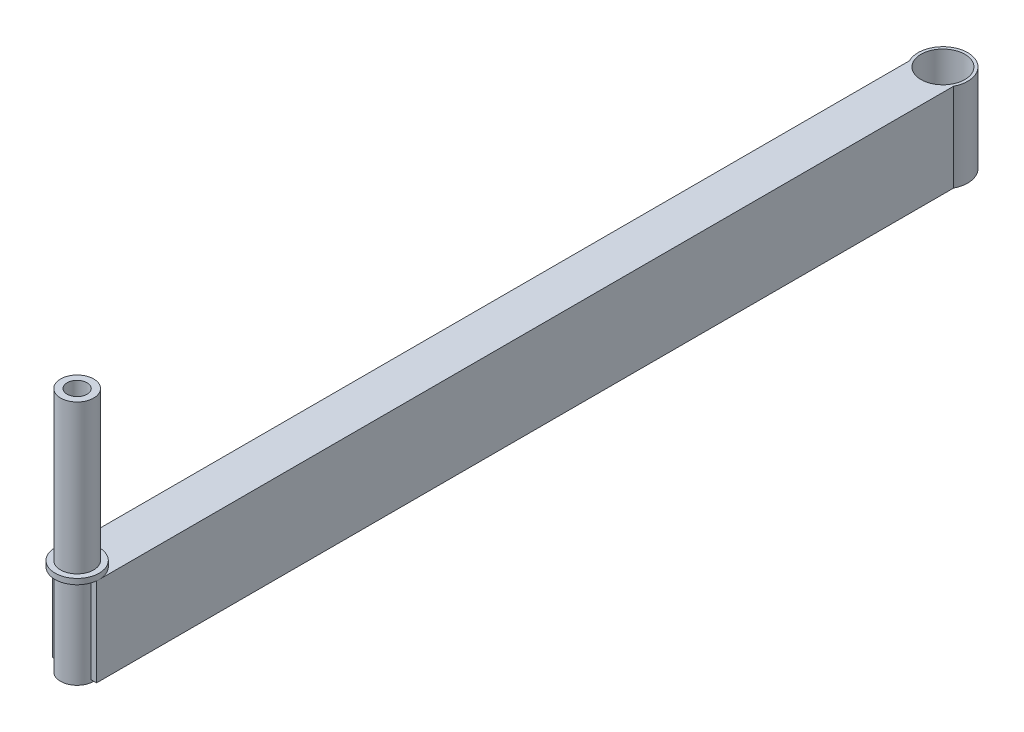
ISO-10303-21;
HEADER;
FILE_DESCRIPTION(('STEP AP214'),'2;1');
FILE_NAME('part.step','',(''),(''),'','','');
FILE_SCHEMA(('AUTOMOTIVE_DESIGN { 1 0 10303 214 1 1 1 1 }'));
ENDSEC;
DATA;
#1=APPLICATION_CONTEXT('core data for automotive mechanical design processes');
#2=APPLICATION_PROTOCOL_DEFINITION('international standard','automotive_design',2000,#1);
#3=PRODUCT_CONTEXT('',#1,'mechanical');
#4=PRODUCT('Part','Part','',(#3));
#5=PRODUCT_RELATED_PRODUCT_CATEGORY('part','',(#4));
#6=PRODUCT_DEFINITION_FORMATION('','',#4);
#7=PRODUCT_DEFINITION_CONTEXT('part definition',#1,'design');
#8=PRODUCT_DEFINITION('design','',#6,#7);
#9=PRODUCT_DEFINITION_SHAPE('','',#8);
#10=(LENGTH_UNIT() NAMED_UNIT(*) SI_UNIT(.MILLI.,.METRE.));
#11=(NAMED_UNIT(*) PLANE_ANGLE_UNIT() SI_UNIT($,.RADIAN.));
#12=(NAMED_UNIT(*) SI_UNIT($,.STERADIAN.) SOLID_ANGLE_UNIT());
#13=UNCERTAINTY_MEASURE_WITH_UNIT(LENGTH_MEASURE(1.E-05),#10,'distance_accuracy_value','');
#14=(GEOMETRIC_REPRESENTATION_CONTEXT(3) GLOBAL_UNCERTAINTY_ASSIGNED_CONTEXT((#13)) GLOBAL_UNIT_ASSIGNED_CONTEXT((#10,
#11,#12)) REPRESENTATION_CONTEXT('',''));
#15=CARTESIAN_POINT('',(0.,0.,0.));
#16=DIRECTION('',(0.,0.,1.));
#17=DIRECTION('',(1.,0.,0.));
#18=AXIS2_PLACEMENT_3D('',#15,#16,#17);
#19=CARTESIAN_POINT('',(0.,-26.9875,498.475));
#20=DIRECTION('',(0.,1.,0.));
#21=DIRECTION('',(0.,0.,1.));
#22=AXIS2_PLACEMENT_3D('',#19,#20,#21);
#23=CYLINDRICAL_SURFACE('',#22,9.525);
#24=DIRECTION('',(0.,1.,0.));
#25=VECTOR('',#24,1.);
#26=CARTESIAN_POINT('',(-9.40228956159084,-26.9875,499.999));
#27=LINE('',#26,#25);
#28=CARTESIAN_POINT('',(-9.40228956159084,25.4,499.999));
#29=VERTEX_POINT('',#28);
#30=CARTESIAN_POINT('',(-9.40228956159084,-25.4,499.999));
#31=VERTEX_POINT('',#30);
#32=EDGE_CURVE('E191',#29,#31,#27,.F.);
#33=ORIENTED_EDGE('',*,*,#32,.T.);
#34=CARTESIAN_POINT('',(0.,-25.4,498.475));
#35=DIRECTION('',(0.,1.,0.));
#36=DIRECTION('',(0.,0.,1.));
#37=AXIS2_PLACEMENT_3D('',#34,#35,#36);
#38=CIRCLE('',#37,9.525);
#39=CARTESIAN_POINT('',(9.40228956159083,-25.4,499.999));
#40=VERTEX_POINT('',#39);
#41=EDGE_CURVE('E179',#40,#31,#38,.T.);
#42=ORIENTED_EDGE('',*,*,#41,.F.);
#43=DIRECTION('',(0.,1.,0.));
#44=VECTOR('',#43,1.);
#45=CARTESIAN_POINT('',(9.40228956159083,-26.9875,499.999));
#46=LINE('',#45,#44);
#47=CARTESIAN_POINT('',(9.40228956159083,25.4,499.999));
#48=VERTEX_POINT('',#47);
#49=EDGE_CURVE('E202',#40,#48,#46,.T.);
#50=ORIENTED_EDGE('',*,*,#49,.T.);
#51=CARTESIAN_POINT('',(0.,25.4,498.475));
#52=DIRECTION('',(0.,1.,0.));
#53=DIRECTION('',(0.,0.,1.));
#54=AXIS2_PLACEMENT_3D('',#51,#52,#53);
#55=CIRCLE('',#54,9.525);
#56=EDGE_CURVE('E318',#48,#29,#55,.F.);
#57=ORIENTED_EDGE('',*,*,#56,.T.);
#58=EDGE_LOOP('',(#33,#42,#50,#57));
#59=FACE_BOUND('',#58,.T.);
#60=CARTESIAN_POINT('',(0.,-26.9875,498.475));
#61=DIRECTION('',(0.,1.,0.));
#62=DIRECTION('',(0.,0.,1.));
#63=AXIS2_PLACEMENT_3D('',#60,#61,#62);
#64=CIRCLE('',#63,9.525);
#65=CARTESIAN_POINT('',(0.,-26.9875,508.));
#66=VERTEX_POINT('',#65);
#67=EDGE_CURVE('E236',#66,#66,#64,.T.);
#68=ORIENTED_EDGE('',*,*,#67,.T.);
#69=EDGE_LOOP('',(#68));
#70=FACE_BOUND('',#69,.T.);
#71=ADVANCED_FACE('F48',(#59,#70),#23,.T.);
#72=CARTESIAN_POINT('',(0.,-26.9875,498.475));
#73=DIRECTION('',(0.,1.,0.));
#74=DIRECTION('',(0.,0.,1.));
#75=AXIS2_PLACEMENT_3D('',#72,#73,#74);
#76=CYLINDRICAL_SURFACE('',#75,6.35);
#77=CARTESIAN_POINT('',(0.,-26.9875,498.475));
#78=DIRECTION('',(0.,1.,0.));
#79=DIRECTION('',(0.,0.,1.));
#80=AXIS2_PLACEMENT_3D('',#77,#78,#79);
#81=CIRCLE('',#80,6.35);
#82=CARTESIAN_POINT('',(0.,-26.9875,504.825));
#83=VERTEX_POINT('',#82);
#84=EDGE_CURVE('E233',#83,#83,#81,.T.);
#85=ORIENTED_EDGE('',*,*,#84,.F.);
#86=EDGE_LOOP('',(#85));
#87=FACE_BOUND('',#86,.T.);
#88=CARTESIAN_POINT('',(0.,95.25,498.475));
#89=DIRECTION('',(0.,1.,0.));
#90=DIRECTION('',(0.,0.,1.));
#91=AXIS2_PLACEMENT_3D('',#88,#89,#90);
#92=CIRCLE('',#91,6.35);
#93=CARTESIAN_POINT('',(0.,95.25,504.825));
#94=VERTEX_POINT('',#93);
#95=EDGE_CURVE('E11',#94,#94,#92,.F.);
#96=ORIENTED_EDGE('',*,*,#95,.F.);
#97=EDGE_LOOP('',(#96));
#98=FACE_BOUND('',#97,.T.);
#99=ADVANCED_FACE('F353',(#87,#98),#76,.F.);
#100=CARTESIAN_POINT('',(-12.7,25.4,498.475));
#101=DIRECTION('',(0.,-1.,0.));
#102=DIRECTION('',(0.,0.,-1.));
#103=AXIS2_PLACEMENT_3D('',#100,#101,#102);
#104=PLANE('',#103);
#105=CARTESIAN_POINT('',(0.,25.4,0.));
#106=DIRECTION('',(0.,1.,0.));
#107=DIRECTION('',(0.,0.,1.));
#108=AXIS2_PLACEMENT_3D('',#105,#106,#107);
#109=CIRCLE('',#108,12.6365);
#110=CARTESIAN_POINT('',(0.,25.4,12.6365));
#111=VERTEX_POINT('',#110);
#112=EDGE_CURVE('E239',#111,#111,#109,.T.);
#113=ORIENTED_EDGE('',*,*,#112,.F.);
#114=EDGE_LOOP('',(#113));
#115=FACE_BOUND('',#114,.T.);
#116=CARTESIAN_POINT('',(0.,25.4,498.475));
#117=DIRECTION('',(0.,1.,0.));
#118=DIRECTION('',(0.,0.,1.));
#119=AXIS2_PLACEMENT_3D('',#116,#117,#118);
#120=CIRCLE('',#119,12.7);
#121=CARTESIAN_POINT('',(12.7,25.4,498.475));
#122=VERTEX_POINT('',#121);
#123=CARTESIAN_POINT('',(-12.7,25.4,498.475));
#124=VERTEX_POINT('',#123);
#125=EDGE_CURVE('E225',#122,#124,#120,.T.);
#126=ORIENTED_EDGE('',*,*,#125,.F.);
#127=DIRECTION('',(0.,0.,-1.));
#128=VECTOR('',#127,1.);
#129=CARTESIAN_POINT('',(12.7,25.4,498.475));
#130=LINE('',#129,#128);
#131=CARTESIAN_POINT('',(12.7,25.4,6.54543018066805));
#132=VERTEX_POINT('',#131);
#133=EDGE_CURVE('E308',#122,#132,#130,.T.);
#134=ORIENTED_EDGE('',*,*,#133,.T.);
#135=CARTESIAN_POINT('',(0.,25.4,0.));
#136=DIRECTION('',(0.,1.,0.));
#137=DIRECTION('',(0.,0.,1.));
#138=AXIS2_PLACEMENT_3D('',#135,#136,#137);
#139=CIRCLE('',#138,14.2875);
#140=CARTESIAN_POINT('',(-12.7,25.4,6.54543018066802));
#141=VERTEX_POINT('',#140);
#142=EDGE_CURVE('E244',#132,#141,#139,.T.);
#143=ORIENTED_EDGE('',*,*,#142,.T.);
#144=DIRECTION('',(0.,0.,-1.));
#145=VECTOR('',#144,1.);
#146=CARTESIAN_POINT('',(-12.7,25.4,498.475));
#147=LINE('',#146,#145);
#148=EDGE_CURVE('E172',#124,#141,#147,.T.);
#149=ORIENTED_EDGE('',*,*,#148,.F.);
#150=EDGE_LOOP('',(#126,#134,#143,#149));
#151=FACE_BOUND('',#150,.T.);
#152=ADVANCED_FACE('F358',(#115,#151),#104,.F.);
#153=CARTESIAN_POINT('',(12.7,-25.4,498.475));
#154=DIRECTION('',(-1.,0.,0.));
#155=DIRECTION('',(0.,0.,1.));
#156=AXIS2_PLACEMENT_3D('',#153,#154,#155);
#157=PLANE('',#156);
#158=DIRECTION('',(0.,0.,-1.));
#159=VECTOR('',#158,1.);
#160=CARTESIAN_POINT('',(12.7,-25.4,498.475));
#161=LINE('',#160,#159);
#162=CARTESIAN_POINT('',(12.7,-25.4,499.999));
#163=VERTEX_POINT('',#162);
#164=CARTESIAN_POINT('',(12.7,-25.4,6.54543018066805));
#165=VERTEX_POINT('',#164);
#166=EDGE_CURVE('E76',#163,#165,#161,.T.);
#167=ORIENTED_EDGE('',*,*,#166,.T.);
#168=DIRECTION('',(0.,1.,0.));
#169=VECTOR('',#168,1.);
#170=CARTESIAN_POINT('',(12.7,-25.4,6.54543018066805));
#171=LINE('',#170,#169);
#172=EDGE_CURVE('E272',#165,#132,#171,.T.);
#173=ORIENTED_EDGE('',*,*,#172,.T.);
#174=ORIENTED_EDGE('',*,*,#133,.F.);
#175=DIRECTION('',(0.,0.,1.));
#176=VECTOR('',#175,1.);
#177=CARTESIAN_POINT('',(12.7,25.4,498.475));
#178=LINE('',#177,#176);
#179=CARTESIAN_POINT('',(12.7,25.4,499.999));
#180=VERTEX_POINT('',#179);
#181=EDGE_CURVE('E196',#122,#180,#178,.T.);
#182=ORIENTED_EDGE('',*,*,#181,.T.);
#183=DIRECTION('',(0.,-1.,0.));
#184=VECTOR('',#183,1.);
#185=CARTESIAN_POINT('',(12.7,25.4,499.999));
#186=LINE('',#185,#184);
#187=EDGE_CURVE('E193',#180,#163,#186,.T.);
#188=ORIENTED_EDGE('',*,*,#187,.T.);
#189=EDGE_LOOP('',(#167,#173,#174,#182,#188));
#190=FACE_BOUND('',#189,.T.);
#191=ADVANCED_FACE('F50',(#190),#157,.F.);
#192=CARTESIAN_POINT('',(-12.7,-25.4,498.475));
#193=DIRECTION('',(1.,0.,0.));
#194=DIRECTION('',(0.,0.,-1.));
#195=AXIS2_PLACEMENT_3D('',#192,#193,#194);
#196=PLANE('',#195);
#197=ORIENTED_EDGE('',*,*,#148,.T.);
#198=DIRECTION('',(0.,1.,0.));
#199=VECTOR('',#198,1.);
#200=CARTESIAN_POINT('',(-12.7,-25.4,6.54543018066802));
#201=LINE('',#200,#199);
#202=CARTESIAN_POINT('',(-12.7,-25.4,6.54543018066802));
#203=VERTEX_POINT('',#202);
#204=EDGE_CURVE('E167',#141,#203,#201,.F.);
#205=ORIENTED_EDGE('',*,*,#204,.T.);
#206=DIRECTION('',(0.,0.,-1.));
#207=VECTOR('',#206,1.);
#208=CARTESIAN_POINT('',(-12.7,-25.4,498.475));
#209=LINE('',#208,#207);
#210=CARTESIAN_POINT('',(-12.7,-25.4,499.999));
#211=VERTEX_POINT('',#210);
#212=EDGE_CURVE('E159',#211,#203,#209,.T.);
#213=ORIENTED_EDGE('',*,*,#212,.F.);
#214=DIRECTION('',(0.,1.,0.));
#215=VECTOR('',#214,1.);
#216=CARTESIAN_POINT('',(-12.7,25.4,499.999));
#217=LINE('',#216,#215);
#218=CARTESIAN_POINT('',(-12.7,25.4,499.999));
#219=VERTEX_POINT('',#218);
#220=EDGE_CURVE('E164',#211,#219,#217,.T.);
#221=ORIENTED_EDGE('',*,*,#220,.T.);
#222=DIRECTION('',(0.,0.,-1.));
#223=VECTOR('',#222,1.);
#224=CARTESIAN_POINT('',(-12.7,25.4,498.475));
#225=LINE('',#224,#223);
#226=EDGE_CURVE('E182',#219,#124,#225,.T.);
#227=ORIENTED_EDGE('',*,*,#226,.T.);
#228=EDGE_LOOP('',(#197,#205,#213,#221,#227));
#229=FACE_BOUND('',#228,.T.);
#230=ADVANCED_FACE('F161',(#229),#196,.F.);
#231=CARTESIAN_POINT('',(-12.7,-25.4,498.475));
#232=DIRECTION('',(0.,1.,0.));
#233=DIRECTION('',(0.,0.,1.));
#234=AXIS2_PLACEMENT_3D('',#231,#232,#233);
#235=PLANE('',#234);
#236=ORIENTED_EDGE('',*,*,#166,.F.);
#237=DIRECTION('',(1.,0.,0.));
#238=VECTOR('',#237,1.);
#239=CARTESIAN_POINT('',(-14.2885,-25.4,499.999));
#240=LINE('',#239,#238);
#241=EDGE_CURVE('E206',#40,#163,#240,.T.);
#242=ORIENTED_EDGE('',*,*,#241,.F.);
#243=ORIENTED_EDGE('',*,*,#41,.T.);
#244=DIRECTION('',(-1.,0.,0.));
#245=VECTOR('',#244,1.);
#246=CARTESIAN_POINT('',(14.2885,-25.4,499.999));
#247=LINE('',#246,#245);
#248=EDGE_CURVE('E175',#31,#211,#247,.T.);
#249=ORIENTED_EDGE('',*,*,#248,.T.);
#250=ORIENTED_EDGE('',*,*,#212,.T.);
#251=CARTESIAN_POINT('',(0.,-25.4,0.));
#252=DIRECTION('',(0.,1.,0.));
#253=DIRECTION('',(0.,0.,1.));
#254=AXIS2_PLACEMENT_3D('',#251,#252,#253);
#255=CIRCLE('',#254,14.2875);
#256=EDGE_CURVE('E248',#165,#203,#255,.T.);
#257=ORIENTED_EDGE('',*,*,#256,.F.);
#258=EDGE_LOOP('',(#236,#242,#243,#249,#250,#257));
#259=FACE_BOUND('',#258,.T.);
#260=CARTESIAN_POINT('',(0.,-25.4,0.));
#261=DIRECTION('',(0.,1.,0.));
#262=DIRECTION('',(0.,0.,1.));
#263=AXIS2_PLACEMENT_3D('',#260,#261,#262);
#264=CIRCLE('',#263,12.6365);
#265=CARTESIAN_POINT('',(0.,-25.4,12.6365));
#266=VERTEX_POINT('',#265);
#267=EDGE_CURVE('E240',#266,#266,#264,.T.);
#268=ORIENTED_EDGE('',*,*,#267,.T.);
#269=EDGE_LOOP('',(#268));
#270=FACE_BOUND('',#269,.T.);
#271=ADVANCED_FACE('F176',(#259,#270),#235,.F.);
#272=CARTESIAN_POINT('',(0.,-25.4,0.));
#273=DIRECTION('',(0.,1.,0.));
#274=DIRECTION('',(0.,0.,1.));
#275=AXIS2_PLACEMENT_3D('',#272,#273,#274);
#276=CYLINDRICAL_SURFACE('',#275,12.6365);
#277=ORIENTED_EDGE('',*,*,#267,.F.);
#278=EDGE_LOOP('',(#277));
#279=FACE_BOUND('',#278,.T.);
#280=ORIENTED_EDGE('',*,*,#112,.T.);
#281=EDGE_LOOP('',(#280));
#282=FACE_BOUND('',#281,.T.);
#283=ADVANCED_FACE('F451',(#279,#282),#276,.F.);
#284=CARTESIAN_POINT('',(0.,-25.4,0.));
#285=DIRECTION('',(0.,1.,0.));
#286=DIRECTION('',(0.,0.,1.));
#287=AXIS2_PLACEMENT_3D('',#284,#285,#286);
#288=CYLINDRICAL_SURFACE('',#287,14.2875);
#289=ORIENTED_EDGE('',*,*,#172,.F.);
#290=ORIENTED_EDGE('',*,*,#256,.T.);
#291=ORIENTED_EDGE('',*,*,#204,.F.);
#292=ORIENTED_EDGE('',*,*,#142,.F.);
#293=EDGE_LOOP('',(#289,#290,#291,#292));
#294=FACE_BOUND('',#293,.T.);
#295=ADVANCED_FACE('F331',(#294),#288,.T.);
#296=CARTESIAN_POINT('',(0.,28.575,498.475));
#297=DIRECTION('',(0.,1.,0.));
#298=DIRECTION('',(0.,0.,1.));
#299=AXIS2_PLACEMENT_3D('',#296,#297,#298);
#300=CIRCLE('',#299,9.525);
#301=CARTESIAN_POINT('',(0.,28.575,508.));
#302=VERTEX_POINT('',#301);
#303=EDGE_CURVE('E58',#302,#302,#300,.F.);
#304=ORIENTED_EDGE('',*,*,#303,.F.);
#305=EDGE_LOOP('',(#304));
#306=FACE_BOUND('',#305,.T.);
#307=CARTESIAN_POINT('',(0.,114.3,498.475));
#308=DIRECTION('',(0.,1.,0.));
#309=DIRECTION('',(0.,0.,1.));
#310=AXIS2_PLACEMENT_3D('',#307,#308,#309);
#311=CIRCLE('',#310,9.525);
#312=CARTESIAN_POINT('',(0.,114.3,508.));
#313=VERTEX_POINT('',#312);
#314=EDGE_CURVE('E224',#313,#313,#311,.T.);
#315=ORIENTED_EDGE('',*,*,#314,.F.);
#316=EDGE_LOOP('',(#315));
#317=FACE_BOUND('',#316,.T.);
#318=ADVANCED_FACE('F327',(#306,#317),#23,.T.);
#319=CARTESIAN_POINT('',(0.,-26.9875,498.475));
#320=DIRECTION('',(0.,1.,0.));
#321=DIRECTION('',(0.,0.,1.));
#322=AXIS2_PLACEMENT_3D('',#319,#320,#321);
#323=PLANE('',#322);
#324=ORIENTED_EDGE('',*,*,#84,.T.);
#325=EDGE_LOOP('',(#324));
#326=FACE_BOUND('',#325,.T.);
#327=ORIENTED_EDGE('',*,*,#67,.F.);
#328=EDGE_LOOP('',(#327));
#329=FACE_BOUND('',#328,.T.);
#330=ADVANCED_FACE('F330',(#326,#329),#323,.F.);
#331=CARTESIAN_POINT('',(0.,114.3,498.475));
#332=DIRECTION('',(0.,1.,0.));
#333=DIRECTION('',(0.,0.,1.));
#334=AXIS2_PLACEMENT_3D('',#331,#332,#333);
#335=PLANE('',#334);
#336=CARTESIAN_POINT('',(0.,114.3,498.475));
#337=DIRECTION('',(0.,1.,0.));
#338=DIRECTION('',(0.,0.,1.));
#339=AXIS2_PLACEMENT_3D('',#336,#337,#338);
#340=CIRCLE('',#339,5.75437);
#341=CARTESIAN_POINT('',(0.,114.3,504.22937));
#342=VERTEX_POINT('',#341);
#343=EDGE_CURVE('E205',#342,#342,#340,.T.);
#344=ORIENTED_EDGE('',*,*,#343,.F.);
#345=EDGE_LOOP('',(#344));
#346=FACE_BOUND('',#345,.T.);
#347=ORIENTED_EDGE('',*,*,#314,.T.);
#348=EDGE_LOOP('',(#347));
#349=FACE_BOUND('',#348,.T.);
#350=ADVANCED_FACE('F336',(#346,#349),#335,.T.);
#351=CARTESIAN_POINT('',(0.,25.4,498.475));
#352=DIRECTION('',(0.,1.,0.));
#353=DIRECTION('',(0.,0.,1.));
#354=AXIS2_PLACEMENT_3D('',#351,#352,#353);
#355=PLANE('',#354);
#356=CARTESIAN_POINT('',(-12.6082284243267,25.4,499.999));
#357=VERTEX_POINT('',#356);
#358=CARTESIAN_POINT('',(12.6082284243267,25.4,499.999));
#359=VERTEX_POINT('',#358);
#360=EDGE_CURVE('E229',#357,#359,#120,.T.);
#361=ORIENTED_EDGE('',*,*,#360,.F.);
#362=DIRECTION('',(-1.,0.,0.));
#363=VECTOR('',#362,1.);
#364=CARTESIAN_POINT('',(14.2885,25.4,499.999));
#365=LINE('',#364,#363);
#366=EDGE_CURVE('E65',#29,#357,#365,.T.);
#367=ORIENTED_EDGE('',*,*,#366,.F.);
#368=ORIENTED_EDGE('',*,*,#56,.F.);
#369=DIRECTION('',(1.,0.,0.));
#370=VECTOR('',#369,1.);
#371=CARTESIAN_POINT('',(-14.2885,25.4,499.999));
#372=LINE('',#371,#370);
#373=EDGE_CURVE('E199',#48,#359,#372,.T.);
#374=ORIENTED_EDGE('',*,*,#373,.T.);
#375=EDGE_LOOP('',(#361,#367,#368,#374));
#376=FACE_BOUND('',#375,.T.);
#377=ADVANCED_FACE('F338',(#376),#355,.F.);
#378=CARTESIAN_POINT('',(0.,28.575,498.475));
#379=DIRECTION('',(0.,1.,0.));
#380=DIRECTION('',(0.,0.,1.));
#381=AXIS2_PLACEMENT_3D('',#378,#379,#380);
#382=PLANE('',#381);
#383=CARTESIAN_POINT('',(0.,28.575,498.475));
#384=DIRECTION('',(0.,1.,0.));
#385=DIRECTION('',(0.,0.,1.));
#386=AXIS2_PLACEMENT_3D('',#383,#384,#385);
#387=CIRCLE('',#386,12.7);
#388=CARTESIAN_POINT('',(0.,28.575,511.175));
#389=VERTEX_POINT('',#388);
#390=EDGE_CURVE('E220',#389,#389,#387,.T.);
#391=ORIENTED_EDGE('',*,*,#390,.T.);
#392=EDGE_LOOP('',(#391));
#393=FACE_BOUND('',#392,.T.);
#394=ORIENTED_EDGE('',*,*,#303,.T.);
#395=EDGE_LOOP('',(#394));
#396=FACE_BOUND('',#395,.T.);
#397=ADVANCED_FACE('F325',(#393,#396),#382,.T.);
#398=CARTESIAN_POINT('',(0.,28.575,498.475));
#399=DIRECTION('',(0.,-1.,0.));
#400=DIRECTION('',(0.,0.,-1.));
#401=AXIS2_PLACEMENT_3D('',#398,#399,#400);
#402=CYLINDRICAL_SURFACE('',#401,12.7);
#403=ORIENTED_EDGE('',*,*,#390,.F.);
#404=EDGE_LOOP('',(#403));
#405=FACE_BOUND('',#404,.T.);
#406=ORIENTED_EDGE('',*,*,#125,.T.);
#407=EDGE_CURVE('E228',#124,#357,#120,.T.);
#408=ORIENTED_EDGE('',*,*,#407,.T.);
#409=ORIENTED_EDGE('',*,*,#360,.T.);
#410=EDGE_CURVE('E219',#359,#122,#120,.T.);
#411=ORIENTED_EDGE('',*,*,#410,.T.);
#412=EDGE_LOOP('',(#406,#408,#409,#411));
#413=FACE_BOUND('',#412,.T.);
#414=ADVANCED_FACE('F401',(#405,#413),#402,.T.);
#415=CARTESIAN_POINT('',(0.,95.25,498.475));
#416=DIRECTION('',(0.,1.,0.));
#417=DIRECTION('',(0.,0.,1.));
#418=AXIS2_PLACEMENT_3D('',#415,#416,#417);
#419=PLANE('',#418);
#420=CARTESIAN_POINT('',(0.,95.25,498.475));
#421=DIRECTION('',(0.,1.,0.));
#422=DIRECTION('',(0.,0.,1.));
#423=AXIS2_PLACEMENT_3D('',#420,#421,#422);
#424=CIRCLE('',#423,5.75437);
#425=CARTESIAN_POINT('',(0.,95.25,504.22937));
#426=VERTEX_POINT('',#425);
#427=EDGE_CURVE('E215',#426,#426,#424,.T.);
#428=ORIENTED_EDGE('',*,*,#427,.T.);
#429=EDGE_LOOP('',(#428));
#430=FACE_BOUND('',#429,.T.);
#431=ORIENTED_EDGE('',*,*,#95,.T.);
#432=EDGE_LOOP('',(#431));
#433=FACE_BOUND('',#432,.T.);
#434=ADVANCED_FACE('F397',(#430,#433),#419,.F.);
#435=CARTESIAN_POINT('',(0.,114.3,498.475));
#436=DIRECTION('',(0.,1.,0.));
#437=DIRECTION('',(0.,0.,1.));
#438=AXIS2_PLACEMENT_3D('',#435,#436,#437);
#439=CYLINDRICAL_SURFACE('',#438,5.75437);
#440=ORIENTED_EDGE('',*,*,#427,.F.);
#441=EDGE_LOOP('',(#440));
#442=FACE_BOUND('',#441,.T.);
#443=ORIENTED_EDGE('',*,*,#343,.T.);
#444=EDGE_LOOP('',(#443));
#445=FACE_BOUND('',#444,.T.);
#446=ADVANCED_FACE('F393',(#442,#445),#439,.F.);
#447=CARTESIAN_POINT('',(-14.2885,25.4,498.475));
#448=DIRECTION('',(0.,1.,0.));
#449=DIRECTION('',(0.,0.,1.));
#450=AXIS2_PLACEMENT_3D('',#447,#448,#449);
#451=PLANE('',#450);
#452=ORIENTED_EDGE('',*,*,#410,.F.);
#453=EDGE_CURVE('E209',#359,#180,#372,.T.);
#454=ORIENTED_EDGE('',*,*,#453,.T.);
#455=ORIENTED_EDGE('',*,*,#181,.F.);
#456=EDGE_LOOP('',(#452,#454,#455));
#457=FACE_BOUND('',#456,.T.);
#458=ADVANCED_FACE('F396',(#457),#451,.T.);
#459=CARTESIAN_POINT('',(-14.2885,25.4,499.999));
#460=DIRECTION('',(0.,0.,1.));
#461=DIRECTION('',(1.,0.,0.));
#462=AXIS2_PLACEMENT_3D('',#459,#460,#461);
#463=PLANE('',#462);
#464=ORIENTED_EDGE('',*,*,#49,.F.);
#465=ORIENTED_EDGE('',*,*,#241,.T.);
#466=ORIENTED_EDGE('',*,*,#187,.F.);
#467=ORIENTED_EDGE('',*,*,#453,.F.);
#468=ORIENTED_EDGE('',*,*,#373,.F.);
#469=EDGE_LOOP('',(#464,#465,#466,#467,#468));
#470=FACE_BOUND('',#469,.T.);
#471=ADVANCED_FACE('F391',(#470),#463,.T.);
#472=CARTESIAN_POINT('',(14.2885,25.4,498.475));
#473=DIRECTION('',(0.,1.,0.));
#474=DIRECTION('',(0.,0.,1.));
#475=AXIS2_PLACEMENT_3D('',#472,#473,#474);
#476=PLANE('',#475);
#477=ORIENTED_EDGE('',*,*,#407,.F.);
#478=ORIENTED_EDGE('',*,*,#226,.F.);
#479=EDGE_CURVE('E181',#357,#219,#365,.T.);
#480=ORIENTED_EDGE('',*,*,#479,.F.);
#481=EDGE_LOOP('',(#477,#478,#480));
#482=FACE_BOUND('',#481,.T.);
#483=ADVANCED_FACE('F547',(#482),#476,.T.);
#484=CARTESIAN_POINT('',(14.2885,25.4,499.999));
#485=DIRECTION('',(0.,0.,1.));
#486=DIRECTION('',(1.,0.,0.));
#487=AXIS2_PLACEMENT_3D('',#484,#485,#486);
#488=PLANE('',#487);
#489=ORIENTED_EDGE('',*,*,#32,.F.);
#490=ORIENTED_EDGE('',*,*,#366,.T.);
#491=ORIENTED_EDGE('',*,*,#479,.T.);
#492=ORIENTED_EDGE('',*,*,#220,.F.);
#493=ORIENTED_EDGE('',*,*,#248,.F.);
#494=EDGE_LOOP('',(#489,#490,#491,#492,#493));
#495=FACE_BOUND('',#494,.T.);
#496=ADVANCED_FACE('F184',(#495),#488,.T.);
#497=CLOSED_SHELL('',(#71,#99,#152,#191,#230,#271,#283,#295,#318,#330,#350,#377,#397,#414,#434,
#446,#458,#471,#483,#496));
#498=CARTESIAN_POINT('',(-14.2885,25.4,498.475));
#499=DIRECTION('',(0.,0.,-1.));
#500=DIRECTION('',(-1.,0.,0.));
#501=AXIS2_PLACEMENT_3D('',#498,#499,#500);
#502=PLANE('',#501);
#503=DIRECTION('',(0.,1.,0.));
#504=VECTOR('',#503,1.);
#505=CARTESIAN_POINT('',(11.1252,-23.8252,498.475));
#506=LINE('',#505,#504);
#507=CARTESIAN_POINT('',(11.1252,-23.8252,498.475));
#508=VERTEX_POINT('',#507);
#509=CARTESIAN_POINT('',(11.1252,23.8252,498.475));
#510=VERTEX_POINT('',#509);
#511=EDGE_CURVE('E279',#508,#510,#506,.T.);
#512=ORIENTED_EDGE('',*,*,#511,.F.);
#513=DIRECTION('',(1.,0.,0.));
#514=VECTOR('',#513,1.);
#515=CARTESIAN_POINT('',(-11.1252,-23.8252,498.475));
#516=LINE('',#515,#514);
#517=CARTESIAN_POINT('',(9.525,-23.8252,498.475));
#518=VERTEX_POINT('',#517);
#519=EDGE_CURVE('E275',#518,#508,#516,.T.);
#520=ORIENTED_EDGE('',*,*,#519,.F.);
#521=DIRECTION('',(0.,1.,0.));
#522=VECTOR('',#521,1.);
#523=CARTESIAN_POINT('',(9.525,-26.9875,498.475));
#524=LINE('',#523,#522);
#525=CARTESIAN_POINT('',(9.525,23.8252,498.475));
#526=VERTEX_POINT('',#525);
#527=EDGE_CURVE('E195',#526,#518,#524,.F.);
#528=ORIENTED_EDGE('',*,*,#527,.F.);
#529=DIRECTION('',(-1.,0.,0.));
#530=VECTOR('',#529,1.);
#531=CARTESIAN_POINT('',(-11.1252,23.8252,498.475));
#532=LINE('',#531,#530);
#533=EDGE_CURVE('E283',#510,#526,#532,.T.);
#534=ORIENTED_EDGE('',*,*,#533,.F.);
#535=EDGE_LOOP('',(#512,#520,#528,#534));
#536=FACE_BOUND('',#535,.T.);
#537=ADVANCED_FACE('F377',(#536),#502,.T.);
#538=CARTESIAN_POINT('',(11.1252,-23.8252,498.475));
#539=DIRECTION('',(-1.,0.,0.));
#540=DIRECTION('',(0.,-1.,0.));
#541=AXIS2_PLACEMENT_3D('',#538,#539,#540);
#542=PLANE('',#541);
#543=DIRECTION('',(0.,1.,0.));
#544=VECTOR('',#543,1.);
#545=CARTESIAN_POINT('',(11.1252,-25.4,8.9645179017056));
#546=LINE('',#545,#544);
#547=CARTESIAN_POINT('',(11.1252,-23.8252,8.9645179017056));
#548=VERTEX_POINT('',#547);
#549=CARTESIAN_POINT('',(11.1252,23.8252,8.9645179017056));
#550=VERTEX_POINT('',#549);
#551=EDGE_CURVE('E262',#548,#550,#546,.T.);
#552=ORIENTED_EDGE('',*,*,#551,.F.);
#553=DIRECTION('',(0.,0.,-1.));
#554=VECTOR('',#553,1.);
#555=CARTESIAN_POINT('',(11.1252,-23.8252,498.475));
#556=LINE('',#555,#554);
#557=EDGE_CURVE('E300',#508,#548,#556,.T.);
#558=ORIENTED_EDGE('',*,*,#557,.F.);
#559=ORIENTED_EDGE('',*,*,#511,.T.);
#560=DIRECTION('',(0.,0.,-1.));
#561=VECTOR('',#560,1.);
#562=CARTESIAN_POINT('',(11.1252,23.8252,498.475));
#563=LINE('',#562,#561);
#564=EDGE_CURVE('E296',#510,#550,#563,.T.);
#565=ORIENTED_EDGE('',*,*,#564,.T.);
#566=EDGE_LOOP('',(#552,#558,#559,#565));
#567=FACE_BOUND('',#566,.T.);
#568=ADVANCED_FACE('F379',(#567),#542,.T.);
#569=DIRECTION('',(0.,1.,0.));
#570=VECTOR('',#569,1.);
#571=CARTESIAN_POINT('',(-11.1252,-25.4,8.96451790170558));
#572=LINE('',#571,#570);
#573=CARTESIAN_POINT('',(-11.1252,23.8252,8.96451790170561));
#574=VERTEX_POINT('',#573);
#575=CARTESIAN_POINT('',(-11.1252,-23.8252,8.96451790170559));
#576=VERTEX_POINT('',#575);
#577=EDGE_CURVE('E311',#574,#576,#572,.F.);
#578=ORIENTED_EDGE('',*,*,#577,.T.);
#579=CARTESIAN_POINT('',(0.,-23.8252,0.));
#580=DIRECTION('',(0.,1.,0.));
#581=DIRECTION('',(0.,0.,1.));
#582=AXIS2_PLACEMENT_3D('',#579,#580,#581);
#583=CIRCLE('',#582,14.2875);
#584=EDGE_CURVE('E266',#576,#548,#583,.T.);
#585=ORIENTED_EDGE('',*,*,#584,.T.);
#586=ORIENTED_EDGE('',*,*,#551,.T.);
#587=CARTESIAN_POINT('',(0.,23.8252,0.));
#588=DIRECTION('',(0.,-1.,0.));
#589=DIRECTION('',(0.,0.,-1.));
#590=AXIS2_PLACEMENT_3D('',#587,#588,#589);
#591=CIRCLE('',#590,14.2875);
#592=EDGE_CURVE('E258',#550,#574,#591,.T.);
#593=ORIENTED_EDGE('',*,*,#592,.T.);
#594=EDGE_LOOP('',(#578,#585,#586,#593));
#595=FACE_BOUND('',#594,.T.);
#596=ADVANCED_FACE('F386',(#595),#288,.T.);
#597=CARTESIAN_POINT('',(-11.1252,-23.8252,498.475));
#598=DIRECTION('',(1.,0.,0.));
#599=DIRECTION('',(0.,0.,-1.));
#600=AXIS2_PLACEMENT_3D('',#597,#598,#599);
#601=PLANE('',#600);
#602=ORIENTED_EDGE('',*,*,#577,.F.);
#603=DIRECTION('',(0.,0.,-1.));
#604=VECTOR('',#603,1.);
#605=CARTESIAN_POINT('',(-11.1252,23.8252,498.475));
#606=LINE('',#605,#604);
#607=CARTESIAN_POINT('',(-11.1252,23.8252,498.475));
#608=VERTEX_POINT('',#607);
#609=EDGE_CURVE('E292',#608,#574,#606,.T.);
#610=ORIENTED_EDGE('',*,*,#609,.F.);
#611=DIRECTION('',(0.,-1.,0.));
#612=VECTOR('',#611,1.);
#613=CARTESIAN_POINT('',(-11.1252,-23.8252,498.475));
#614=LINE('',#613,#612);
#615=CARTESIAN_POINT('',(-11.1252,-23.8252,498.475));
#616=VERTEX_POINT('',#615);
#617=EDGE_CURVE('E286',#608,#616,#614,.T.);
#618=ORIENTED_EDGE('',*,*,#617,.T.);
#619=DIRECTION('',(0.,0.,-1.));
#620=VECTOR('',#619,1.);
#621=CARTESIAN_POINT('',(-11.1252,-23.8252,498.475));
#622=LINE('',#621,#620);
#623=EDGE_CURVE('E289',#616,#576,#622,.T.);
#624=ORIENTED_EDGE('',*,*,#623,.T.);
#625=EDGE_LOOP('',(#602,#610,#618,#624));
#626=FACE_BOUND('',#625,.T.);
#627=ADVANCED_FACE('F439',(#626),#601,.T.);
#628=CARTESIAN_POINT('',(-11.1252,23.8252,498.475));
#629=DIRECTION('',(0.,-1.,0.));
#630=DIRECTION('',(0.,0.,-1.));
#631=AXIS2_PLACEMENT_3D('',#628,#629,#630);
#632=PLANE('',#631);
#633=CARTESIAN_POINT('',(0.,23.8252,498.475));
#634=DIRECTION('',(0.,-1.,0.));
#635=DIRECTION('',(0.,0.,-1.));
#636=AXIS2_PLACEMENT_3D('',#633,#634,#635);
#637=CIRCLE('',#636,9.525);
#638=CARTESIAN_POINT('',(-9.525,23.8252,498.475));
#639=VERTEX_POINT('',#638);
#640=EDGE_CURVE('E315',#639,#526,#637,.T.);
#641=ORIENTED_EDGE('',*,*,#640,.F.);
#642=EDGE_CURVE('E282',#639,#608,#532,.T.);
#643=ORIENTED_EDGE('',*,*,#642,.T.);
#644=ORIENTED_EDGE('',*,*,#609,.T.);
#645=ORIENTED_EDGE('',*,*,#592,.F.);
#646=ORIENTED_EDGE('',*,*,#564,.F.);
#647=ORIENTED_EDGE('',*,*,#533,.T.);
#648=EDGE_LOOP('',(#641,#643,#644,#645,#646,#647));
#649=FACE_BOUND('',#648,.T.);
#650=ADVANCED_FACE('F373',(#649),#632,.T.);
#651=CARTESIAN_POINT('',(-11.1252,-23.8252,498.475));
#652=DIRECTION('',(0.,1.,0.));
#653=DIRECTION('',(0.,0.,1.));
#654=AXIS2_PLACEMENT_3D('',#651,#652,#653);
#655=PLANE('',#654);
#656=CARTESIAN_POINT('',(0.,-23.8252,498.475));
#657=DIRECTION('',(0.,1.,0.));
#658=DIRECTION('',(0.,0.,1.));
#659=AXIS2_PLACEMENT_3D('',#656,#657,#658);
#660=CIRCLE('',#659,9.525);
#661=CARTESIAN_POINT('',(-9.525,-23.8252,498.475));
#662=VERTEX_POINT('',#661);
#663=EDGE_CURVE('E255',#518,#662,#660,.T.);
#664=ORIENTED_EDGE('',*,*,#663,.F.);
#665=ORIENTED_EDGE('',*,*,#519,.T.);
#666=ORIENTED_EDGE('',*,*,#557,.T.);
#667=ORIENTED_EDGE('',*,*,#584,.F.);
#668=ORIENTED_EDGE('',*,*,#623,.F.);
#669=EDGE_CURVE('E276',#616,#662,#516,.T.);
#670=ORIENTED_EDGE('',*,*,#669,.T.);
#671=EDGE_LOOP('',(#664,#665,#666,#667,#668,#670));
#672=FACE_BOUND('',#671,.T.);
#673=ADVANCED_FACE('F364',(#672),#655,.T.);
#674=DIRECTION('',(0.,1.,0.));
#675=VECTOR('',#674,1.);
#676=CARTESIAN_POINT('',(-9.525,-26.9875,498.475));
#677=LINE('',#676,#675);
#678=EDGE_CURVE('E188',#662,#639,#677,.T.);
#679=ORIENTED_EDGE('',*,*,#678,.T.);
#680=ORIENTED_EDGE('',*,*,#640,.T.);
#681=ORIENTED_EDGE('',*,*,#527,.T.);
#682=ORIENTED_EDGE('',*,*,#663,.T.);
#683=EDGE_LOOP('',(#679,#680,#681,#682));
#684=FACE_BOUND('',#683,.T.);
#685=ADVANCED_FACE('F333',(#684),#23,.T.);
#686=CARTESIAN_POINT('',(14.2885,25.4,498.475));
#687=DIRECTION('',(0.,0.,-1.));
#688=DIRECTION('',(-1.,0.,0.));
#689=AXIS2_PLACEMENT_3D('',#686,#687,#688);
#690=PLANE('',#689);
#691=ORIENTED_EDGE('',*,*,#678,.F.);
#692=ORIENTED_EDGE('',*,*,#669,.F.);
#693=ORIENTED_EDGE('',*,*,#617,.F.);
#694=ORIENTED_EDGE('',*,*,#642,.F.);
#695=EDGE_LOOP('',(#691,#692,#693,#694));
#696=FACE_BOUND('',#695,.T.);
#697=ADVANCED_FACE('F363',(#696),#690,.T.);
#698=CLOSED_SHELL('',(#537,#568,#596,#627,#650,#673,#685,#697));
#699=ORIENTED_CLOSED_SHELL('',*,#698,.T.);
#700=BREP_WITH_VOIDS('B2',#497,(#699));
#701=ADVANCED_BREP_SHAPE_REPRESENTATION('',(#18,#700),#14);
#702=SHAPE_DEFINITION_REPRESENTATION(#9,#701);
ENDSEC;
END-ISO-10303-21;
